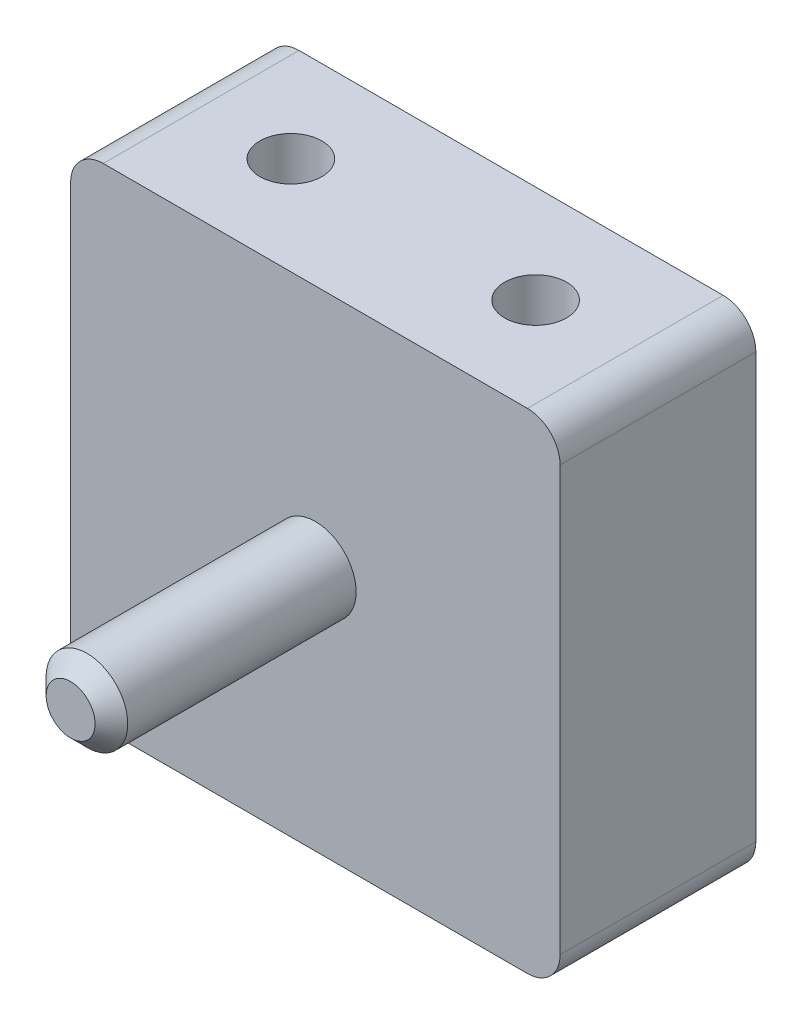
ISO-10303-21;
HEADER;
FILE_DESCRIPTION(('STEP AP214'),'2;1');
FILE_NAME('part.step','',(''),(''),'','','');
FILE_SCHEMA(('AUTOMOTIVE_DESIGN { 1 0 10303 214 1 1 1 1 }'));
ENDSEC;
DATA;
#1=APPLICATION_CONTEXT('core data for automotive mechanical design processes');
#2=APPLICATION_PROTOCOL_DEFINITION('international standard','automotive_design',2000,#1);
#3=PRODUCT_CONTEXT('',#1,'mechanical');
#4=PRODUCT('Part','Part','',(#3));
#5=PRODUCT_RELATED_PRODUCT_CATEGORY('part','',(#4));
#6=PRODUCT_DEFINITION_FORMATION('','',#4);
#7=PRODUCT_DEFINITION_CONTEXT('part definition',#1,'design');
#8=PRODUCT_DEFINITION('design','',#6,#7);
#9=PRODUCT_DEFINITION_SHAPE('','',#8);
#10=(LENGTH_UNIT() NAMED_UNIT(*) SI_UNIT(.MILLI.,.METRE.));
#11=(NAMED_UNIT(*) PLANE_ANGLE_UNIT() SI_UNIT($,.RADIAN.));
#12=(NAMED_UNIT(*) SI_UNIT($,.STERADIAN.) SOLID_ANGLE_UNIT());
#13=UNCERTAINTY_MEASURE_WITH_UNIT(LENGTH_MEASURE(1.E-05),#10,'distance_accuracy_value','');
#14=(GEOMETRIC_REPRESENTATION_CONTEXT(3) GLOBAL_UNCERTAINTY_ASSIGNED_CONTEXT((#13)) GLOBAL_UNIT_ASSIGNED_CONTEXT((#10,
#11,#12)) REPRESENTATION_CONTEXT('',''));
#15=CARTESIAN_POINT('',(0.,0.,0.));
#16=DIRECTION('',(0.,0.,1.));
#17=DIRECTION('',(1.,0.,0.));
#18=AXIS2_PLACEMENT_3D('',#15,#16,#17);
#19=CARTESIAN_POINT('',(0.,0.,15.24));
#20=DIRECTION('',(0.,0.,1.));
#21=DIRECTION('',(1.,0.,0.));
#22=AXIS2_PLACEMENT_3D('',#19,#20,#21);
#23=PLANE('',#22);
#24=CARTESIAN_POINT('',(0.,0.,15.24));
#25=DIRECTION('',(0.,0.,1.));
#26=DIRECTION('',(1.,0.,0.));
#27=AXIS2_PLACEMENT_3D('',#24,#25,#26);
#28=CIRCLE('',#27,3.175);
#29=CARTESIAN_POINT('',(3.175,0.,15.24));
#30=VERTEX_POINT('',#29);
#31=EDGE_CURVE('E244',#30,#30,#28,.T.);
#32=ORIENTED_EDGE('',*,*,#31,.F.);
#33=EDGE_LOOP('',(#32));
#34=FACE_BOUND('',#33,.T.);
#35=DIRECTION('',(0.,-1.,0.));
#36=VECTOR('',#35,1.);
#37=CARTESIAN_POINT('',(-19.05,-19.05,15.24));
#38=LINE('',#37,#36);
#39=CARTESIAN_POINT('',(-19.05,16.51,15.24));
#40=VERTEX_POINT('',#39);
#41=CARTESIAN_POINT('',(-19.05,-16.51,15.24));
#42=VERTEX_POINT('',#41);
#43=EDGE_CURVE('E143',#40,#42,#38,.T.);
#44=ORIENTED_EDGE('',*,*,#43,.T.);
#45=CARTESIAN_POINT('',(-16.51,-16.51,15.24));
#46=DIRECTION('',(0.,0.,1.));
#47=DIRECTION('',(1.,0.,0.));
#48=AXIS2_PLACEMENT_3D('',#45,#46,#47);
#49=CIRCLE('',#48,2.54);
#50=CARTESIAN_POINT('',(-16.51,-19.05,15.24));
#51=VERTEX_POINT('',#50);
#52=EDGE_CURVE('E158',#42,#51,#49,.T.);
#53=ORIENTED_EDGE('',*,*,#52,.T.);
#54=DIRECTION('',(1.,0.,0.));
#55=VECTOR('',#54,1.);
#56=CARTESIAN_POINT('',(19.05,-19.05,15.24));
#57=LINE('',#56,#55);
#58=CARTESIAN_POINT('',(16.51,-19.05,15.24));
#59=VERTEX_POINT('',#58);
#60=EDGE_CURVE('E125',#51,#59,#57,.T.);
#61=ORIENTED_EDGE('',*,*,#60,.T.);
#62=CARTESIAN_POINT('',(16.51,-16.51,15.24));
#63=DIRECTION('',(0.,0.,1.));
#64=DIRECTION('',(1.,0.,0.));
#65=AXIS2_PLACEMENT_3D('',#62,#63,#64);
#66=CIRCLE('',#65,2.54);
#67=CARTESIAN_POINT('',(19.05,-16.51,15.24));
#68=VERTEX_POINT('',#67);
#69=EDGE_CURVE('E156',#59,#68,#66,.T.);
#70=ORIENTED_EDGE('',*,*,#69,.T.);
#71=DIRECTION('',(0.,1.,0.));
#72=VECTOR('',#71,1.);
#73=CARTESIAN_POINT('',(19.05,-19.05,15.24));
#74=LINE('',#73,#72);
#75=CARTESIAN_POINT('',(19.05,16.51,15.24));
#76=VERTEX_POINT('',#75);
#77=EDGE_CURVE('E232',#68,#76,#74,.T.);
#78=ORIENTED_EDGE('',*,*,#77,.T.);
#79=CARTESIAN_POINT('',(16.51,16.51,15.24));
#80=DIRECTION('',(0.,0.,1.));
#81=DIRECTION('',(1.,0.,0.));
#82=AXIS2_PLACEMENT_3D('',#79,#80,#81);
#83=CIRCLE('',#82,2.54);
#84=CARTESIAN_POINT('',(16.51,19.05,15.24));
#85=VERTEX_POINT('',#84);
#86=EDGE_CURVE('E60',#76,#85,#83,.T.);
#87=ORIENTED_EDGE('',*,*,#86,.T.);
#88=DIRECTION('',(-1.,0.,0.));
#89=VECTOR('',#88,1.);
#90=CARTESIAN_POINT('',(19.05,19.05,15.24));
#91=LINE('',#90,#89);
#92=CARTESIAN_POINT('',(-16.51,19.05,15.24));
#93=VERTEX_POINT('',#92);
#94=EDGE_CURVE('E144',#85,#93,#91,.T.);
#95=ORIENTED_EDGE('',*,*,#94,.T.);
#96=CARTESIAN_POINT('',(-16.51,16.51,15.24));
#97=DIRECTION('',(0.,0.,1.));
#98=DIRECTION('',(1.,0.,0.));
#99=AXIS2_PLACEMENT_3D('',#96,#97,#98);
#100=CIRCLE('',#99,2.54);
#101=EDGE_CURVE('E153',#93,#40,#100,.T.);
#102=ORIENTED_EDGE('',*,*,#101,.T.);
#103=EDGE_LOOP('',(#44,#53,#61,#70,#78,#87,#95,#102));
#104=FACE_BOUND('',#103,.T.);
#105=ADVANCED_FACE('F38',(#34,#104),#23,.T.);
#106=CARTESIAN_POINT('',(0.,0.,0.));
#107=DIRECTION('',(0.,0.,1.));
#108=DIRECTION('',(1.,0.,0.));
#109=AXIS2_PLACEMENT_3D('',#106,#107,#108);
#110=PLANE('',#109);
#111=DIRECTION('',(1.,0.,0.));
#112=VECTOR('',#111,1.);
#113=CARTESIAN_POINT('',(19.05,-19.05,0.));
#114=LINE('',#113,#112);
#115=CARTESIAN_POINT('',(-16.51,-19.05,0.));
#116=VERTEX_POINT('',#115);
#117=CARTESIAN_POINT('',(16.51,-19.05,0.));
#118=VERTEX_POINT('',#117);
#119=EDGE_CURVE('E122',#116,#118,#114,.T.);
#120=ORIENTED_EDGE('',*,*,#119,.F.);
#121=CARTESIAN_POINT('',(-16.51,-16.51,0.));
#122=DIRECTION('',(0.,0.,1.));
#123=DIRECTION('',(1.,0.,0.));
#124=AXIS2_PLACEMENT_3D('',#121,#122,#123);
#125=CIRCLE('',#124,2.54);
#126=CARTESIAN_POINT('',(-19.05,-16.51,0.));
#127=VERTEX_POINT('',#126);
#128=EDGE_CURVE('E105',#116,#127,#125,.F.);
#129=ORIENTED_EDGE('',*,*,#128,.T.);
#130=DIRECTION('',(0.,-1.,0.));
#131=VECTOR('',#130,1.);
#132=CARTESIAN_POINT('',(-19.05,-19.05,0.));
#133=LINE('',#132,#131);
#134=CARTESIAN_POINT('',(-19.05,16.51,0.));
#135=VERTEX_POINT('',#134);
#136=EDGE_CURVE('E133',#135,#127,#133,.T.);
#137=ORIENTED_EDGE('',*,*,#136,.F.);
#138=CARTESIAN_POINT('',(-16.51,16.51,0.));
#139=DIRECTION('',(0.,0.,1.));
#140=DIRECTION('',(1.,0.,0.));
#141=AXIS2_PLACEMENT_3D('',#138,#139,#140);
#142=CIRCLE('',#141,2.54);
#143=CARTESIAN_POINT('',(-16.51,19.05,0.));
#144=VERTEX_POINT('',#143);
#145=EDGE_CURVE('E126',#135,#144,#142,.F.);
#146=ORIENTED_EDGE('',*,*,#145,.T.);
#147=DIRECTION('',(-1.,0.,0.));
#148=VECTOR('',#147,1.);
#149=CARTESIAN_POINT('',(19.05,19.05,0.));
#150=LINE('',#149,#148);
#151=CARTESIAN_POINT('',(16.51,19.05,0.));
#152=VERTEX_POINT('',#151);
#153=EDGE_CURVE('E136',#152,#144,#150,.T.);
#154=ORIENTED_EDGE('',*,*,#153,.F.);
#155=CARTESIAN_POINT('',(16.51,16.51,0.));
#156=DIRECTION('',(0.,0.,1.));
#157=DIRECTION('',(1.,0.,0.));
#158=AXIS2_PLACEMENT_3D('',#155,#156,#157);
#159=CIRCLE('',#158,2.54);
#160=CARTESIAN_POINT('',(19.05,16.51,0.));
#161=VERTEX_POINT('',#160);
#162=EDGE_CURVE('E147',#152,#161,#159,.F.);
#163=ORIENTED_EDGE('',*,*,#162,.T.);
#164=DIRECTION('',(0.,1.,0.));
#165=VECTOR('',#164,1.);
#166=CARTESIAN_POINT('',(19.05,-19.05,0.));
#167=LINE('',#166,#165);
#168=CARTESIAN_POINT('',(19.05,-16.51,0.));
#169=VERTEX_POINT('',#168);
#170=EDGE_CURVE('E132',#169,#161,#167,.T.);
#171=ORIENTED_EDGE('',*,*,#170,.F.);
#172=CARTESIAN_POINT('',(16.51,-16.51,0.));
#173=DIRECTION('',(0.,0.,1.));
#174=DIRECTION('',(1.,0.,0.));
#175=AXIS2_PLACEMENT_3D('',#172,#173,#174);
#176=CIRCLE('',#175,2.54);
#177=EDGE_CURVE('E116',#169,#118,#176,.F.);
#178=ORIENTED_EDGE('',*,*,#177,.T.);
#179=EDGE_LOOP('',(#120,#129,#137,#146,#154,#163,#171,#178));
#180=FACE_BOUND('',#179,.T.);
#181=CARTESIAN_POINT('',(0.,0.,0.));
#182=DIRECTION('',(0.,0.,1.));
#183=DIRECTION('',(1.,0.,0.));
#184=AXIS2_PLACEMENT_3D('',#181,#182,#183);
#185=CIRCLE('',#184,1.5875);
#186=CARTESIAN_POINT('',(1.5875,0.,0.));
#187=VERTEX_POINT('',#186);
#188=EDGE_CURVE('E138',#187,#187,#185,.T.);
#189=ORIENTED_EDGE('',*,*,#188,.T.);
#190=EDGE_LOOP('',(#189));
#191=FACE_BOUND('',#190,.T.);
#192=ADVANCED_FACE('F129',(#180,#191),#110,.F.);
#193=CARTESIAN_POINT('',(-19.05,-19.05,15.24));
#194=DIRECTION('',(1.,0.,0.));
#195=DIRECTION('',(0.,0.,-1.));
#196=AXIS2_PLACEMENT_3D('',#193,#194,#195);
#197=PLANE('',#196);
#198=ORIENTED_EDGE('',*,*,#136,.T.);
#199=DIRECTION('',(0.,0.,-1.));
#200=VECTOR('',#199,1.);
#201=CARTESIAN_POINT('',(-19.05,-16.51,15.24));
#202=LINE('',#201,#200);
#203=EDGE_CURVE('E110',#127,#42,#202,.F.);
#204=ORIENTED_EDGE('',*,*,#203,.T.);
#205=ORIENTED_EDGE('',*,*,#43,.F.);
#206=DIRECTION('',(0.,0.,-1.));
#207=VECTOR('',#206,1.);
#208=CARTESIAN_POINT('',(-19.05,16.51,15.24));
#209=LINE('',#208,#207);
#210=EDGE_CURVE('E115',#40,#135,#209,.T.);
#211=ORIENTED_EDGE('',*,*,#210,.T.);
#212=EDGE_LOOP('',(#198,#204,#205,#211));
#213=FACE_BOUND('',#212,.T.);
#214=ADVANCED_FACE('F193',(#213),#197,.F.);
#215=CARTESIAN_POINT('',(19.05,-19.05,15.24));
#216=DIRECTION('',(0.,1.,0.));
#217=DIRECTION('',(-1.,0.,0.));
#218=AXIS2_PLACEMENT_3D('',#215,#216,#217);
#219=PLANE('',#218);
#220=CARTESIAN_POINT('',(-9.525,-19.05,7.62));
#221=DIRECTION('',(0.,-1.,0.));
#222=DIRECTION('',(1.,0.,0.));
#223=AXIS2_PLACEMENT_3D('',#220,#221,#222);
#224=CIRCLE('',#223,2.413);
#225=CARTESIAN_POINT('',(-7.112,-19.05,7.62));
#226=VERTEX_POINT('',#225);
#227=EDGE_CURVE('E247',#226,#226,#224,.T.);
#228=ORIENTED_EDGE('',*,*,#227,.F.);
#229=EDGE_LOOP('',(#228));
#230=FACE_BOUND('',#229,.T.);
#231=CARTESIAN_POINT('',(9.525,-19.05,7.62));
#232=DIRECTION('',(0.,-1.,0.));
#233=DIRECTION('',(1.,0.,0.));
#234=AXIS2_PLACEMENT_3D('',#231,#232,#233);
#235=CIRCLE('',#234,2.413);
#236=CARTESIAN_POINT('',(11.938,-19.05,7.62));
#237=VERTEX_POINT('',#236);
#238=EDGE_CURVE('E248',#237,#237,#235,.T.);
#239=ORIENTED_EDGE('',*,*,#238,.F.);
#240=EDGE_LOOP('',(#239));
#241=FACE_BOUND('',#240,.T.);
#242=ORIENTED_EDGE('',*,*,#60,.F.);
#243=DIRECTION('',(0.,0.,-1.));
#244=VECTOR('',#243,1.);
#245=CARTESIAN_POINT('',(-16.51,-19.05,15.24));
#246=LINE('',#245,#244);
#247=EDGE_CURVE('E109',#51,#116,#246,.T.);
#248=ORIENTED_EDGE('',*,*,#247,.T.);
#249=ORIENTED_EDGE('',*,*,#119,.T.);
#250=DIRECTION('',(0.,0.,-1.));
#251=VECTOR('',#250,1.);
#252=CARTESIAN_POINT('',(16.51,-19.05,15.24));
#253=LINE('',#252,#251);
#254=EDGE_CURVE('E127',#118,#59,#253,.F.);
#255=ORIENTED_EDGE('',*,*,#254,.T.);
#256=EDGE_LOOP('',(#242,#248,#249,#255));
#257=FACE_BOUND('',#256,.T.);
#258=ADVANCED_FACE('F121',(#230,#241,#257),#219,.F.);
#259=CARTESIAN_POINT('',(19.05,-19.05,15.24));
#260=DIRECTION('',(-1.,0.,0.));
#261=DIRECTION('',(0.,0.,1.));
#262=AXIS2_PLACEMENT_3D('',#259,#260,#261);
#263=PLANE('',#262);
#264=ORIENTED_EDGE('',*,*,#77,.F.);
#265=DIRECTION('',(0.,0.,-1.));
#266=VECTOR('',#265,1.);
#267=CARTESIAN_POINT('',(19.05,-16.51,15.24));
#268=LINE('',#267,#266);
#269=EDGE_CURVE('E162',#68,#169,#268,.T.);
#270=ORIENTED_EDGE('',*,*,#269,.T.);
#271=ORIENTED_EDGE('',*,*,#170,.T.);
#272=DIRECTION('',(0.,0.,-1.));
#273=VECTOR('',#272,1.);
#274=CARTESIAN_POINT('',(19.05,16.51,15.24));
#275=LINE('',#274,#273);
#276=EDGE_CURVE('E160',#161,#76,#275,.F.);
#277=ORIENTED_EDGE('',*,*,#276,.T.);
#278=EDGE_LOOP('',(#264,#270,#271,#277));
#279=FACE_BOUND('',#278,.T.);
#280=ADVANCED_FACE('F203',(#279),#263,.F.);
#281=CARTESIAN_POINT('',(19.05,19.05,15.24));
#282=DIRECTION('',(0.,-1.,0.));
#283=DIRECTION('',(1.,0.,0.));
#284=AXIS2_PLACEMENT_3D('',#281,#282,#283);
#285=PLANE('',#284);
#286=CARTESIAN_POINT('',(9.525,19.05,7.62));
#287=DIRECTION('',(0.,1.,0.));
#288=DIRECTION('',(-1.,0.,0.));
#289=AXIS2_PLACEMENT_3D('',#286,#287,#288);
#290=CIRCLE('',#289,2.413);
#291=CARTESIAN_POINT('',(7.112,19.05,7.62));
#292=VERTEX_POINT('',#291);
#293=EDGE_CURVE('E251',#292,#292,#290,.T.);
#294=ORIENTED_EDGE('',*,*,#293,.F.);
#295=EDGE_LOOP('',(#294));
#296=FACE_BOUND('',#295,.T.);
#297=CARTESIAN_POINT('',(-9.525,19.05,7.62));
#298=DIRECTION('',(0.,1.,0.));
#299=DIRECTION('',(-1.,0.,0.));
#300=AXIS2_PLACEMENT_3D('',#297,#298,#299);
#301=CIRCLE('',#300,2.413);
#302=CARTESIAN_POINT('',(-11.938,19.05,7.62));
#303=VERTEX_POINT('',#302);
#304=EDGE_CURVE('E254',#303,#303,#301,.T.);
#305=ORIENTED_EDGE('',*,*,#304,.F.);
#306=EDGE_LOOP('',(#305));
#307=FACE_BOUND('',#306,.T.);
#308=ORIENTED_EDGE('',*,*,#94,.F.);
#309=DIRECTION('',(0.,0.,-1.));
#310=VECTOR('',#309,1.);
#311=CARTESIAN_POINT('',(16.51,19.05,15.24));
#312=LINE('',#311,#310);
#313=EDGE_CURVE('E166',#85,#152,#312,.T.);
#314=ORIENTED_EDGE('',*,*,#313,.T.);
#315=ORIENTED_EDGE('',*,*,#153,.T.);
#316=DIRECTION('',(0.,0.,-1.));
#317=VECTOR('',#316,1.);
#318=CARTESIAN_POINT('',(-16.51,19.05,15.24));
#319=LINE('',#318,#317);
#320=EDGE_CURVE('E53',#144,#93,#319,.F.);
#321=ORIENTED_EDGE('',*,*,#320,.T.);
#322=EDGE_LOOP('',(#308,#314,#315,#321));
#323=FACE_BOUND('',#322,.T.);
#324=ADVANCED_FACE('F200',(#296,#307,#323),#285,.F.);
#325=CARTESIAN_POINT('',(0.,0.,15.24));
#326=DIRECTION('',(0.,0.,-1.));
#327=DIRECTION('',(-1.,0.,0.));
#328=AXIS2_PLACEMENT_3D('',#325,#326,#327);
#329=CYLINDRICAL_SURFACE('',#328,1.5875);
#330=CARTESIAN_POINT('',(0.,0.,15.24));
#331=DIRECTION('',(0.,0.,1.));
#332=DIRECTION('',(1.,0.,0.));
#333=AXIS2_PLACEMENT_3D('',#330,#331,#332);
#334=CIRCLE('',#333,1.5875);
#335=CARTESIAN_POINT('',(1.5875,0.,15.24));
#336=VERTEX_POINT('',#335);
#337=EDGE_CURVE('E241',#336,#336,#334,.T.);
#338=ORIENTED_EDGE('',*,*,#337,.T.);
#339=EDGE_LOOP('',(#338));
#340=FACE_BOUND('',#339,.T.);
#341=ORIENTED_EDGE('',*,*,#188,.F.);
#342=EDGE_LOOP('',(#341));
#343=FACE_BOUND('',#342,.T.);
#344=ADVANCED_FACE('F197',(#340,#343),#329,.F.);
#345=CARTESIAN_POINT('',(0.,0.,15.24));
#346=DIRECTION('',(0.,0.,1.));
#347=DIRECTION('',(1.,0.,0.));
#348=AXIS2_PLACEMENT_3D('',#345,#346,#347);
#349=PLANE('',#348);
#350=ORIENTED_EDGE('',*,*,#337,.F.);
#351=EDGE_LOOP('',(#350));
#352=FACE_BOUND('',#351,.T.);
#353=ADVANCED_FACE('F272',(#352),#349,.F.);
#354=CARTESIAN_POINT('',(0.,0.,34.29));
#355=DIRECTION('',(0.,0.,-1.));
#356=DIRECTION('',(-1.,0.,0.));
#357=AXIS2_PLACEMENT_3D('',#354,#355,#356);
#358=CYLINDRICAL_SURFACE('',#357,3.175);
#359=CARTESIAN_POINT('',(0.,0.,33.02));
#360=DIRECTION('',(0.,0.,1.));
#361=DIRECTION('',(1.,0.,0.));
#362=AXIS2_PLACEMENT_3D('',#359,#360,#361);
#363=CIRCLE('',#362,3.175);
#364=CARTESIAN_POINT('',(3.175,0.,33.02));
#365=VERTEX_POINT('',#364);
#366=EDGE_CURVE('E11',#365,#365,#363,.F.);
#367=ORIENTED_EDGE('',*,*,#366,.T.);
#368=EDGE_LOOP('',(#367));
#369=FACE_BOUND('',#368,.T.);
#370=ORIENTED_EDGE('',*,*,#31,.T.);
#371=EDGE_LOOP('',(#370));
#372=FACE_BOUND('',#371,.T.);
#373=ADVANCED_FACE('F271',(#369,#372),#358,.T.);
#374=CARTESIAN_POINT('',(0.,0.,34.29));
#375=DIRECTION('',(0.,0.,1.));
#376=DIRECTION('',(1.,0.,0.));
#377=AXIS2_PLACEMENT_3D('',#374,#375,#376);
#378=PLANE('',#377);
#379=CARTESIAN_POINT('',(0.,0.,34.29));
#380=DIRECTION('',(0.,0.,1.));
#381=DIRECTION('',(1.,0.,0.));
#382=AXIS2_PLACEMENT_3D('',#379,#380,#381);
#383=CIRCLE('',#382,1.90500000000002);
#384=CARTESIAN_POINT('',(1.90500000000002,0.,34.29));
#385=VERTEX_POINT('',#384);
#386=EDGE_CURVE('E46',#385,#385,#383,.T.);
#387=ORIENTED_EDGE('',*,*,#386,.T.);
#388=EDGE_LOOP('',(#387));
#389=FACE_BOUND('',#388,.T.);
#390=ADVANCED_FACE('F171',(#389),#378,.T.);
#391=CARTESIAN_POINT('',(-16.51,-16.51,15.24));
#392=DIRECTION('',(0.,0.,-1.));
#393=DIRECTION('',(-1.,0.,0.));
#394=AXIS2_PLACEMENT_3D('',#391,#392,#393);
#395=CYLINDRICAL_SURFACE('',#394,2.54);
#396=ORIENTED_EDGE('',*,*,#52,.F.);
#397=ORIENTED_EDGE('',*,*,#203,.F.);
#398=ORIENTED_EDGE('',*,*,#128,.F.);
#399=ORIENTED_EDGE('',*,*,#247,.F.);
#400=EDGE_LOOP('',(#396,#397,#398,#399));
#401=FACE_BOUND('',#400,.T.);
#402=ADVANCED_FACE('F108',(#401),#395,.T.);
#403=CARTESIAN_POINT('',(16.51,-16.51,15.24));
#404=DIRECTION('',(0.,0.,-1.));
#405=DIRECTION('',(-1.,0.,0.));
#406=AXIS2_PLACEMENT_3D('',#403,#404,#405);
#407=CYLINDRICAL_SURFACE('',#406,2.54);
#408=ORIENTED_EDGE('',*,*,#69,.F.);
#409=ORIENTED_EDGE('',*,*,#254,.F.);
#410=ORIENTED_EDGE('',*,*,#177,.F.);
#411=ORIENTED_EDGE('',*,*,#269,.F.);
#412=EDGE_LOOP('',(#408,#409,#410,#411));
#413=FACE_BOUND('',#412,.T.);
#414=ADVANCED_FACE('F216',(#413),#407,.T.);
#415=CARTESIAN_POINT('',(16.51,16.51,15.24));
#416=DIRECTION('',(0.,0.,-1.));
#417=DIRECTION('',(-1.,0.,0.));
#418=AXIS2_PLACEMENT_3D('',#415,#416,#417);
#419=CYLINDRICAL_SURFACE('',#418,2.54);
#420=ORIENTED_EDGE('',*,*,#86,.F.);
#421=ORIENTED_EDGE('',*,*,#276,.F.);
#422=ORIENTED_EDGE('',*,*,#162,.F.);
#423=ORIENTED_EDGE('',*,*,#313,.F.);
#424=EDGE_LOOP('',(#420,#421,#422,#423));
#425=FACE_BOUND('',#424,.T.);
#426=ADVANCED_FACE('F184',(#425),#419,.T.);
#427=CARTESIAN_POINT('',(-16.51,16.51,15.24));
#428=DIRECTION('',(0.,0.,-1.));
#429=DIRECTION('',(-1.,0.,0.));
#430=AXIS2_PLACEMENT_3D('',#427,#428,#429);
#431=CYLINDRICAL_SURFACE('',#430,2.54);
#432=ORIENTED_EDGE('',*,*,#101,.F.);
#433=ORIENTED_EDGE('',*,*,#320,.F.);
#434=ORIENTED_EDGE('',*,*,#145,.F.);
#435=ORIENTED_EDGE('',*,*,#210,.F.);
#436=EDGE_LOOP('',(#432,#433,#434,#435));
#437=FACE_BOUND('',#436,.T.);
#438=ADVANCED_FACE('F175',(#437),#431,.T.);
#439=CARTESIAN_POINT('',(0.,0.,34.29));
#440=DIRECTION('',(0.,0.,-1.));
#441=DIRECTION('',(-1.,0.,0.));
#442=AXIS2_PLACEMENT_3D('',#439,#440,#441);
#443=CONICAL_SURFACE('',#442,1.90500000000002,0.785398163397447);
#444=ORIENTED_EDGE('',*,*,#366,.F.);
#445=EDGE_LOOP('',(#444));
#446=FACE_BOUND('',#445,.T.);
#447=ORIENTED_EDGE('',*,*,#386,.F.);
#448=EDGE_LOOP('',(#447));
#449=FACE_BOUND('',#448,.T.);
#450=ADVANCED_FACE('F40',(#446,#449),#443,.T.);
#451=CARTESIAN_POINT('',(9.525,-11.43,7.62));
#452=DIRECTION('',(0.,-1.,0.));
#453=DIRECTION('',(1.,0.,0.));
#454=AXIS2_PLACEMENT_3D('',#451,#452,#453);
#455=CYLINDRICAL_SURFACE('',#454,2.413);
#456=ORIENTED_EDGE('',*,*,#238,.T.);
#457=EDGE_LOOP('',(#456));
#458=FACE_BOUND('',#457,.T.);
#459=ORIENTED_EDGE('',*,*,#293,.T.);
#460=EDGE_LOOP('',(#459));
#461=FACE_BOUND('',#460,.T.);
#462=ADVANCED_FACE('F174',(#458,#461),#455,.F.);
#463=CARTESIAN_POINT('',(-9.525,-11.43,7.62));
#464=DIRECTION('',(0.,-1.,0.));
#465=DIRECTION('',(1.,0.,0.));
#466=AXIS2_PLACEMENT_3D('',#463,#464,#465);
#467=CYLINDRICAL_SURFACE('',#466,2.413);
#468=ORIENTED_EDGE('',*,*,#227,.T.);
#469=EDGE_LOOP('',(#468));
#470=FACE_BOUND('',#469,.T.);
#471=ORIENTED_EDGE('',*,*,#304,.T.);
#472=EDGE_LOOP('',(#471));
#473=FACE_BOUND('',#472,.T.);
#474=ADVANCED_FACE('F181',(#470,#473),#467,.F.);
#475=CLOSED_SHELL('',(#105,#192,#214,#258,#280,#324,#344,#353,#373,#390,#402,#414,#426,#438,
#450,#462,#474));
#476=MANIFOLD_SOLID_BREP('B2',#475);
#477=ADVANCED_BREP_SHAPE_REPRESENTATION('',(#18,#476),#14);
#478=SHAPE_DEFINITION_REPRESENTATION(#9,#477);
ENDSEC;
END-ISO-10303-21;
